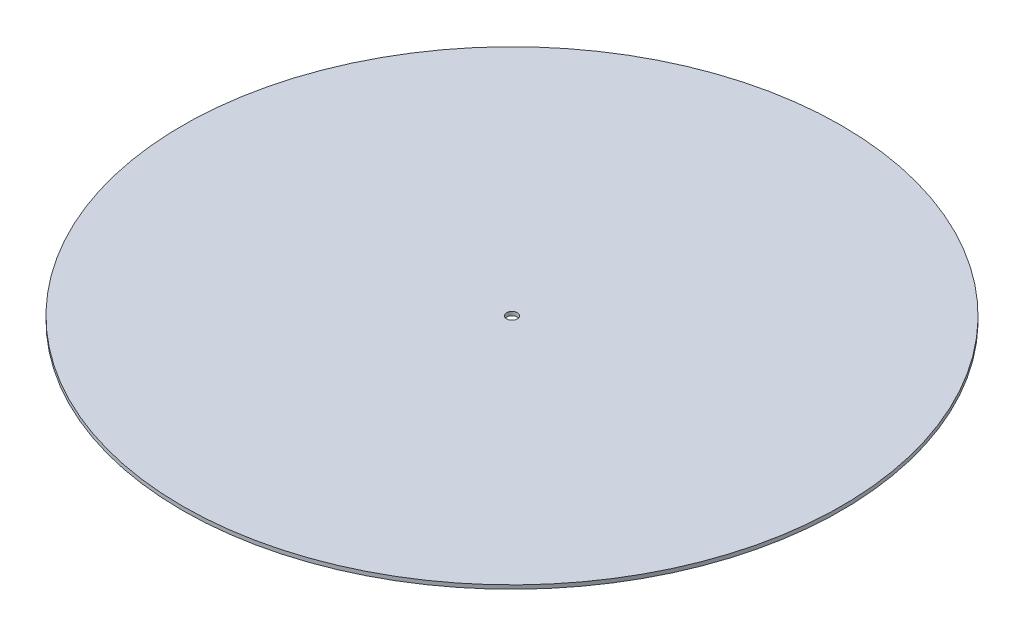
ISO-10303-21;
HEADER;
FILE_DESCRIPTION(('STEP AP214'),'2;1');
FILE_NAME('part.step','',(''),(''),'','','');
FILE_SCHEMA(('AUTOMOTIVE_DESIGN { 1 0 10303 214 1 1 1 1 }'));
ENDSEC;
DATA;
#1=APPLICATION_CONTEXT('core data for automotive mechanical design processes');
#2=APPLICATION_PROTOCOL_DEFINITION('international standard','automotive_design',2000,#1);
#3=PRODUCT_CONTEXT('',#1,'mechanical');
#4=PRODUCT('Part','Part','',(#3));
#5=PRODUCT_RELATED_PRODUCT_CATEGORY('part','',(#4));
#6=PRODUCT_DEFINITION_FORMATION('','',#4);
#7=PRODUCT_DEFINITION_CONTEXT('part definition',#1,'design');
#8=PRODUCT_DEFINITION('design','',#6,#7);
#9=PRODUCT_DEFINITION_SHAPE('','',#8);
#10=(LENGTH_UNIT() NAMED_UNIT(*) SI_UNIT(.MILLI.,.METRE.));
#11=(NAMED_UNIT(*) PLANE_ANGLE_UNIT() SI_UNIT($,.RADIAN.));
#12=(NAMED_UNIT(*) SI_UNIT($,.STERADIAN.) SOLID_ANGLE_UNIT());
#13=UNCERTAINTY_MEASURE_WITH_UNIT(LENGTH_MEASURE(1.E-05),#10,'distance_accuracy_value','');
#14=(GEOMETRIC_REPRESENTATION_CONTEXT(3) GLOBAL_UNCERTAINTY_ASSIGNED_CONTEXT((#13)) GLOBAL_UNIT_ASSIGNED_CONTEXT((#10,
#11,#12)) REPRESENTATION_CONTEXT('',''));
#15=CARTESIAN_POINT('',(0.,0.,0.));
#16=DIRECTION('',(0.,0.,1.));
#17=DIRECTION('',(1.,0.,0.));
#18=AXIS2_PLACEMENT_3D('',#15,#16,#17);
#19=CARTESIAN_POINT('',(0.,6.35,0.));
#20=DIRECTION('',(0.,1.,0.));
#21=DIRECTION('',(0.,0.,1.));
#22=AXIS2_PLACEMENT_3D('',#19,#20,#21);
#23=PLANE('',#22);
#24=CARTESIAN_POINT('',(0.,6.35,0.));
#25=DIRECTION('',(0.,1.,0.));
#26=DIRECTION('',(0.,0.,1.));
#27=AXIS2_PLACEMENT_3D('',#24,#25,#26);
#28=CIRCLE('',#27,550.);
#29=CARTESIAN_POINT('',(0.,6.35,550.));
#30=VERTEX_POINT('',#29);
#31=EDGE_CURVE('E10',#30,#30,#28,.T.);
#32=ORIENTED_EDGE('',*,*,#31,.T.);
#33=EDGE_LOOP('',(#32));
#34=FACE_BOUND('',#33,.T.);
#35=CARTESIAN_POINT('',(0.,6.35,0.));
#36=DIRECTION('',(0.,1.,0.));
#37=DIRECTION('',(0.,0.,1.));
#38=AXIS2_PLACEMENT_3D('',#35,#36,#37);
#39=CIRCLE('',#38,9.00000000000001);
#40=CARTESIAN_POINT('',(0.,6.35,9.00000000000001));
#41=VERTEX_POINT('',#40);
#42=EDGE_CURVE('E41',#41,#41,#39,.T.);
#43=ORIENTED_EDGE('',*,*,#42,.F.);
#44=EDGE_LOOP('',(#43));
#45=FACE_BOUND('',#44,.T.);
#46=ADVANCED_FACE('F30',(#34,#45),#23,.T.);
#47=CARTESIAN_POINT('',(0.,0.,0.));
#48=DIRECTION('',(0.,1.,0.));
#49=DIRECTION('',(0.,0.,1.));
#50=AXIS2_PLACEMENT_3D('',#47,#48,#49);
#51=PLANE('',#50);
#52=CARTESIAN_POINT('',(0.,0.,0.));
#53=DIRECTION('',(0.,1.,0.));
#54=DIRECTION('',(0.,0.,1.));
#55=AXIS2_PLACEMENT_3D('',#52,#53,#54);
#56=CIRCLE('',#55,550.);
#57=CARTESIAN_POINT('',(0.,0.,550.));
#58=VERTEX_POINT('',#57);
#59=EDGE_CURVE('E34',#58,#58,#56,.T.);
#60=ORIENTED_EDGE('',*,*,#59,.F.);
#61=EDGE_LOOP('',(#60));
#62=FACE_BOUND('',#61,.T.);
#63=CARTESIAN_POINT('',(0.,0.,0.));
#64=DIRECTION('',(0.,1.,0.));
#65=DIRECTION('',(0.,0.,1.));
#66=AXIS2_PLACEMENT_3D('',#63,#64,#65);
#67=CIRCLE('',#66,9.00000000000001);
#68=CARTESIAN_POINT('',(0.,0.,9.00000000000001));
#69=VERTEX_POINT('',#68);
#70=EDGE_CURVE('E43',#69,#69,#67,.T.);
#71=ORIENTED_EDGE('',*,*,#70,.T.);
#72=EDGE_LOOP('',(#71));
#73=FACE_BOUND('',#72,.T.);
#74=ADVANCED_FACE('F53',(#62,#73),#51,.F.);
#75=CARTESIAN_POINT('',(0.,6.35,0.));
#76=DIRECTION('',(0.,-1.,0.));
#77=DIRECTION('',(0.,0.,-1.));
#78=AXIS2_PLACEMENT_3D('',#75,#76,#77);
#79=CYLINDRICAL_SURFACE('',#78,550.);
#80=ORIENTED_EDGE('',*,*,#31,.F.);
#81=EDGE_LOOP('',(#80));
#82=FACE_BOUND('',#81,.T.);
#83=ORIENTED_EDGE('',*,*,#59,.T.);
#84=EDGE_LOOP('',(#83));
#85=FACE_BOUND('',#84,.T.);
#86=ADVANCED_FACE('F32',(#82,#85),#79,.T.);
#87=CARTESIAN_POINT('',(0.,6.35,0.));
#88=DIRECTION('',(0.,-1.,0.));
#89=DIRECTION('',(0.,0.,-1.));
#90=AXIS2_PLACEMENT_3D('',#87,#88,#89);
#91=CYLINDRICAL_SURFACE('',#90,9.00000000000001);
#92=ORIENTED_EDGE('',*,*,#42,.T.);
#93=EDGE_LOOP('',(#92));
#94=FACE_BOUND('',#93,.T.);
#95=ORIENTED_EDGE('',*,*,#70,.F.);
#96=EDGE_LOOP('',(#95));
#97=FACE_BOUND('',#96,.T.);
#98=ADVANCED_FACE('F49',(#94,#97),#91,.F.);
#99=CLOSED_SHELL('',(#46,#74,#86,#98));
#100=MANIFOLD_SOLID_BREP('B2',#99);
#101=ADVANCED_BREP_SHAPE_REPRESENTATION('',(#18,#100),#14);
#102=SHAPE_DEFINITION_REPRESENTATION(#9,#101);
ENDSEC;
END-ISO-10303-21;
